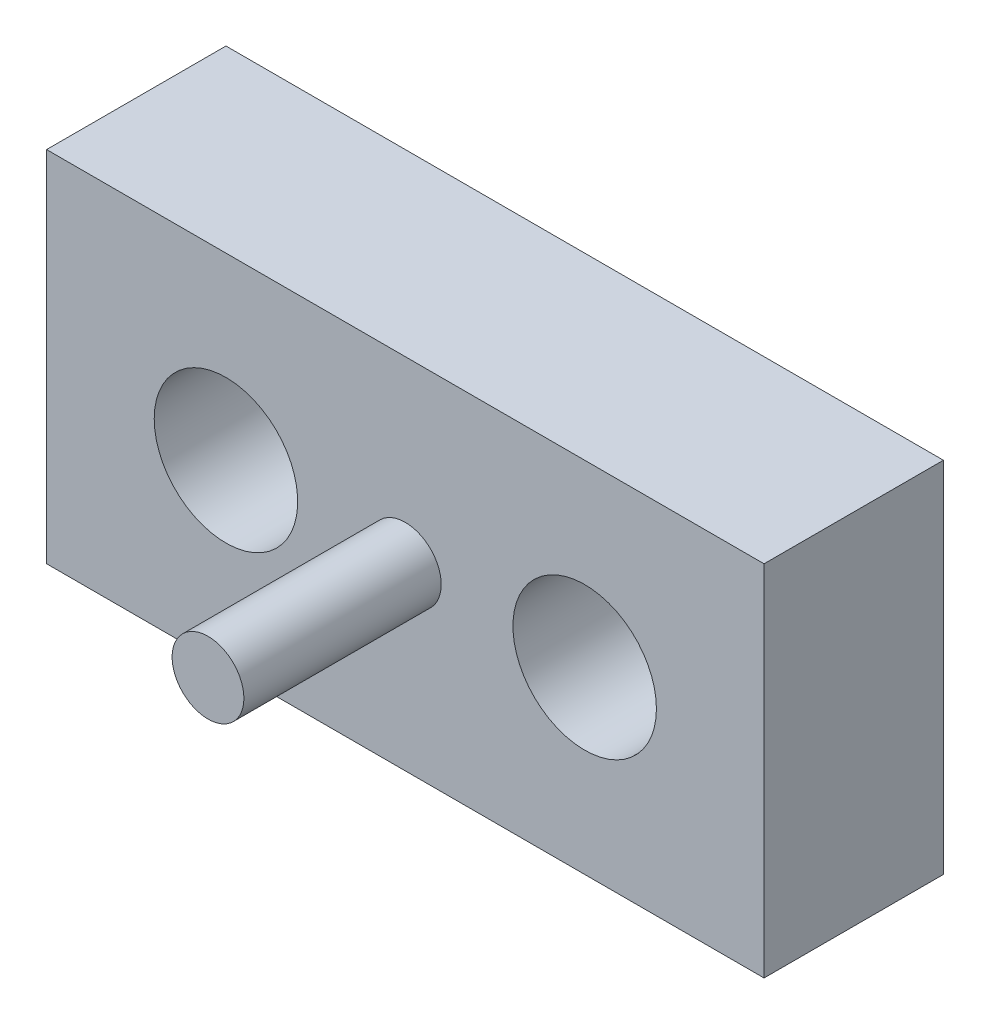
ISO-10303-21;
HEADER;
FILE_DESCRIPTION(('STEP AP214'),'2;1');
FILE_NAME('part.step','',(''),(''),'','','');
FILE_SCHEMA(('AUTOMOTIVE_DESIGN { 1 0 10303 214 1 1 1 1 }'));
ENDSEC;
DATA;
#1=APPLICATION_CONTEXT('core data for automotive mechanical design processes');
#2=APPLICATION_PROTOCOL_DEFINITION('international standard','automotive_design',2000,#1);
#3=PRODUCT_CONTEXT('',#1,'mechanical');
#4=PRODUCT('Part','Part','',(#3));
#5=PRODUCT_RELATED_PRODUCT_CATEGORY('part','',(#4));
#6=PRODUCT_DEFINITION_FORMATION('','',#4);
#7=PRODUCT_DEFINITION_CONTEXT('part definition',#1,'design');
#8=PRODUCT_DEFINITION('design','',#6,#7);
#9=PRODUCT_DEFINITION_SHAPE('','',#8);
#10=(LENGTH_UNIT() NAMED_UNIT(*) SI_UNIT(.MILLI.,.METRE.));
#11=(NAMED_UNIT(*) PLANE_ANGLE_UNIT() SI_UNIT($,.RADIAN.));
#12=(NAMED_UNIT(*) SI_UNIT($,.STERADIAN.) SOLID_ANGLE_UNIT());
#13=UNCERTAINTY_MEASURE_WITH_UNIT(LENGTH_MEASURE(1.E-05),#10,'distance_accuracy_value','');
#14=(GEOMETRIC_REPRESENTATION_CONTEXT(3) GLOBAL_UNCERTAINTY_ASSIGNED_CONTEXT((#13)) GLOBAL_UNIT_ASSIGNED_CONTEXT((#10,
#11,#12)) REPRESENTATION_CONTEXT('',''));
#15=CARTESIAN_POINT('',(0.,0.,0.));
#16=DIRECTION('',(0.,0.,1.));
#17=DIRECTION('',(1.,0.,0.));
#18=AXIS2_PLACEMENT_3D('',#15,#16,#17);
#19=CARTESIAN_POINT('',(4.99999999999999,0.,5.));
#20=DIRECTION('',(0.,0.,-1.));
#21=DIRECTION('',(-1.,0.,0.));
#22=AXIS2_PLACEMENT_3D('',#19,#20,#21);
#23=CYLINDRICAL_SURFACE('',#22,1.);
#24=CARTESIAN_POINT('',(4.99999999999999,0.,0.));
#25=DIRECTION('',(0.,0.,1.));
#26=DIRECTION('',(-1.,0.,0.));
#27=AXIS2_PLACEMENT_3D('',#24,#25,#26);
#28=CIRCLE('',#27,1.);
#29=CARTESIAN_POINT('',(3.99999999999999,0.,0.));
#30=VERTEX_POINT('',#29);
#31=EDGE_CURVE('E156',#30,#30,#28,.T.);
#32=ORIENTED_EDGE('',*,*,#31,.F.);
#33=EDGE_LOOP('',(#32));
#34=FACE_BOUND('',#33,.T.);
#35=CARTESIAN_POINT('',(4.99999999999999,0.,2.));
#36=DIRECTION('',(0.,0.,1.));
#37=DIRECTION('',(1.,0.,0.));
#38=AXIS2_PLACEMENT_3D('',#35,#36,#37);
#39=CIRCLE('',#38,1.);
#40=CARTESIAN_POINT('',(5.99999999999999,0.,2.));
#41=VERTEX_POINT('',#40);
#42=EDGE_CURVE('E125',#41,#41,#39,.T.);
#43=ORIENTED_EDGE('',*,*,#42,.T.);
#44=EDGE_LOOP('',(#43));
#45=FACE_BOUND('',#44,.T.);
#46=ADVANCED_FACE('F39',(#34,#45),#23,.F.);
#47=CARTESIAN_POINT('',(0.,0.,5.));
#48=DIRECTION('',(0.,0.,1.));
#49=DIRECTION('',(1.,0.,0.));
#50=AXIS2_PLACEMENT_3D('',#47,#48,#49);
#51=PLANE('',#50);
#52=CARTESIAN_POINT('',(4.99999999999999,0.,5.));
#53=DIRECTION('',(0.,0.,1.));
#54=DIRECTION('',(1.,0.,0.));
#55=AXIS2_PLACEMENT_3D('',#52,#53,#54);
#56=CIRCLE('',#55,2.);
#57=CARTESIAN_POINT('',(6.99999999999999,0.,5.));
#58=VERTEX_POINT('',#57);
#59=EDGE_CURVE('E136',#58,#58,#56,.T.);
#60=ORIENTED_EDGE('',*,*,#59,.F.);
#61=EDGE_LOOP('',(#60));
#62=FACE_BOUND('',#61,.T.);
#63=CARTESIAN_POINT('',(-4.99999999999999,0.,5.));
#64=DIRECTION('',(0.,0.,1.));
#65=DIRECTION('',(-1.,0.,0.));
#66=AXIS2_PLACEMENT_3D('',#63,#64,#65);
#67=CIRCLE('',#66,2.);
#68=CARTESIAN_POINT('',(-6.99999999999999,0.,5.));
#69=VERTEX_POINT('',#68);
#70=EDGE_CURVE('E148',#69,#69,#67,.T.);
#71=ORIENTED_EDGE('',*,*,#70,.F.);
#72=EDGE_LOOP('',(#71));
#73=FACE_BOUND('',#72,.T.);
#74=CARTESIAN_POINT('',(0.,0.,5.));
#75=DIRECTION('',(0.,0.,1.));
#76=DIRECTION('',(1.,0.,0.));
#77=AXIS2_PLACEMENT_3D('',#74,#75,#76);
#78=CIRCLE('',#77,1.);
#79=CARTESIAN_POINT('',(1.,0.,5.));
#80=VERTEX_POINT('',#79);
#81=EDGE_CURVE('E134',#80,#80,#78,.T.);
#82=ORIENTED_EDGE('',*,*,#81,.F.);
#83=EDGE_LOOP('',(#82));
#84=FACE_BOUND('',#83,.T.);
#85=DIRECTION('',(0.,1.,0.));
#86=VECTOR('',#85,1.);
#87=CARTESIAN_POINT('',(9.99999999999999,5.,5.));
#88=LINE('',#87,#86);
#89=CARTESIAN_POINT('',(9.99999999999999,-5.,5.));
#90=VERTEX_POINT('',#89);
#91=CARTESIAN_POINT('',(9.99999999999999,5.,5.));
#92=VERTEX_POINT('',#91);
#93=EDGE_CURVE('E94',#90,#92,#88,.T.);
#94=ORIENTED_EDGE('',*,*,#93,.T.);
#95=DIRECTION('',(-1.,0.,0.));
#96=VECTOR('',#95,1.);
#97=CARTESIAN_POINT('',(-10.,5.,5.));
#98=LINE('',#97,#96);
#99=CARTESIAN_POINT('',(-10.,5.,5.));
#100=VERTEX_POINT('',#99);
#101=EDGE_CURVE('E89',#92,#100,#98,.T.);
#102=ORIENTED_EDGE('',*,*,#101,.T.);
#103=DIRECTION('',(0.,-1.,0.));
#104=VECTOR('',#103,1.);
#105=CARTESIAN_POINT('',(-10.,5.,5.));
#106=LINE('',#105,#104);
#107=CARTESIAN_POINT('',(-10.,-5.,5.));
#108=VERTEX_POINT('',#107);
#109=EDGE_CURVE('E92',#100,#108,#106,.T.);
#110=ORIENTED_EDGE('',*,*,#109,.T.);
#111=DIRECTION('',(1.,0.,0.));
#112=VECTOR('',#111,1.);
#113=CARTESIAN_POINT('',(-10.,-5.,5.));
#114=LINE('',#113,#112);
#115=EDGE_CURVE('E59',#108,#90,#114,.T.);
#116=ORIENTED_EDGE('',*,*,#115,.T.);
#117=EDGE_LOOP('',(#94,#102,#110,#116));
#118=FACE_BOUND('',#117,.T.);
#119=ADVANCED_FACE('F90',(#62,#73,#84,#118),#51,.T.);
#120=CARTESIAN_POINT('',(0.,0.,0.));
#121=DIRECTION('',(0.,0.,1.));
#122=DIRECTION('',(1.,0.,0.));
#123=AXIS2_PLACEMENT_3D('',#120,#121,#122);
#124=PLANE('',#123);
#125=DIRECTION('',(0.,1.,0.));
#126=VECTOR('',#125,1.);
#127=CARTESIAN_POINT('',(9.99999999999999,5.,0.));
#128=LINE('',#127,#126);
#129=CARTESIAN_POINT('',(9.99999999999999,-5.,0.));
#130=VERTEX_POINT('',#129);
#131=CARTESIAN_POINT('',(9.99999999999999,5.,0.));
#132=VERTEX_POINT('',#131);
#133=EDGE_CURVE('E111',#130,#132,#128,.T.);
#134=ORIENTED_EDGE('',*,*,#133,.F.);
#135=DIRECTION('',(1.,0.,0.));
#136=VECTOR('',#135,1.);
#137=CARTESIAN_POINT('',(-10.,-5.,0.));
#138=LINE('',#137,#136);
#139=CARTESIAN_POINT('',(-10.,-5.,0.));
#140=VERTEX_POINT('',#139);
#141=EDGE_CURVE('E82',#140,#130,#138,.T.);
#142=ORIENTED_EDGE('',*,*,#141,.F.);
#143=DIRECTION('',(0.,-1.,0.));
#144=VECTOR('',#143,1.);
#145=CARTESIAN_POINT('',(-10.,5.,0.));
#146=LINE('',#145,#144);
#147=CARTESIAN_POINT('',(-10.,5.,0.));
#148=VERTEX_POINT('',#147);
#149=EDGE_CURVE('E76',#148,#140,#146,.T.);
#150=ORIENTED_EDGE('',*,*,#149,.F.);
#151=DIRECTION('',(-1.,0.,0.));
#152=VECTOR('',#151,1.);
#153=CARTESIAN_POINT('',(-10.,5.,0.));
#154=LINE('',#153,#152);
#155=EDGE_CURVE('E99',#132,#148,#154,.T.);
#156=ORIENTED_EDGE('',*,*,#155,.F.);
#157=EDGE_LOOP('',(#134,#142,#150,#156));
#158=FACE_BOUND('',#157,.T.);
#159=CARTESIAN_POINT('',(-5.,0.,0.));
#160=DIRECTION('',(0.,0.,1.));
#161=DIRECTION('',(1.,0.,0.));
#162=AXIS2_PLACEMENT_3D('',#159,#160,#161);
#163=CIRCLE('',#162,1.);
#164=CARTESIAN_POINT('',(-4.,0.,0.));
#165=VERTEX_POINT('',#164);
#166=EDGE_CURVE('E115',#165,#165,#163,.T.);
#167=ORIENTED_EDGE('',*,*,#166,.T.);
#168=EDGE_LOOP('',(#167));
#169=FACE_BOUND('',#168,.T.);
#170=ORIENTED_EDGE('',*,*,#31,.T.);
#171=EDGE_LOOP('',(#170));
#172=FACE_BOUND('',#171,.T.);
#173=ADVANCED_FACE('F168',(#158,#169,#172),#124,.F.);
#174=CARTESIAN_POINT('',(9.99999999999999,5.,5.));
#175=DIRECTION('',(-1.,0.,0.));
#176=DIRECTION('',(0.,-1.,0.));
#177=AXIS2_PLACEMENT_3D('',#174,#175,#176);
#178=PLANE('',#177);
#179=ORIENTED_EDGE('',*,*,#133,.T.);
#180=DIRECTION('',(0.,0.,-1.));
#181=VECTOR('',#180,1.);
#182=CARTESIAN_POINT('',(9.99999999999999,5.,5.));
#183=LINE('',#182,#181);
#184=EDGE_CURVE('E11',#92,#132,#183,.T.);
#185=ORIENTED_EDGE('',*,*,#184,.F.);
#186=ORIENTED_EDGE('',*,*,#93,.F.);
#187=DIRECTION('',(0.,0.,-1.));
#188=VECTOR('',#187,1.);
#189=CARTESIAN_POINT('',(9.99999999999999,-5.,5.));
#190=LINE('',#189,#188);
#191=EDGE_CURVE('E107',#90,#130,#190,.T.);
#192=ORIENTED_EDGE('',*,*,#191,.T.);
#193=EDGE_LOOP('',(#179,#185,#186,#192));
#194=FACE_BOUND('',#193,.T.);
#195=ADVANCED_FACE('F41',(#194),#178,.F.);
#196=CARTESIAN_POINT('',(-10.,5.,5.));
#197=DIRECTION('',(0.,-1.,0.));
#198=DIRECTION('',(0.,0.,-1.));
#199=AXIS2_PLACEMENT_3D('',#196,#197,#198);
#200=PLANE('',#199);
#201=ORIENTED_EDGE('',*,*,#155,.T.);
#202=DIRECTION('',(0.,0.,-1.));
#203=VECTOR('',#202,1.);
#204=CARTESIAN_POINT('',(-10.,5.,5.));
#205=LINE('',#204,#203);
#206=EDGE_CURVE('E50',#100,#148,#205,.T.);
#207=ORIENTED_EDGE('',*,*,#206,.F.);
#208=ORIENTED_EDGE('',*,*,#101,.F.);
#209=ORIENTED_EDGE('',*,*,#184,.T.);
#210=EDGE_LOOP('',(#201,#207,#208,#209));
#211=FACE_BOUND('',#210,.T.);
#212=ADVANCED_FACE('F98',(#211),#200,.F.);
#213=CARTESIAN_POINT('',(-10.,5.,5.));
#214=DIRECTION('',(1.,0.,0.));
#215=DIRECTION('',(0.,0.,-1.));
#216=AXIS2_PLACEMENT_3D('',#213,#214,#215);
#217=PLANE('',#216);
#218=ORIENTED_EDGE('',*,*,#149,.T.);
#219=DIRECTION('',(0.,0.,-1.));
#220=VECTOR('',#219,1.);
#221=CARTESIAN_POINT('',(-10.,-5.,5.));
#222=LINE('',#221,#220);
#223=EDGE_CURVE('E101',#108,#140,#222,.T.);
#224=ORIENTED_EDGE('',*,*,#223,.F.);
#225=ORIENTED_EDGE('',*,*,#109,.F.);
#226=ORIENTED_EDGE('',*,*,#206,.T.);
#227=EDGE_LOOP('',(#218,#224,#225,#226));
#228=FACE_BOUND('',#227,.T.);
#229=ADVANCED_FACE('F103',(#228),#217,.F.);
#230=CARTESIAN_POINT('',(-10.,-5.,5.));
#231=DIRECTION('',(0.,1.,0.));
#232=DIRECTION('',(0.,0.,1.));
#233=AXIS2_PLACEMENT_3D('',#230,#231,#232);
#234=PLANE('',#233);
#235=ORIENTED_EDGE('',*,*,#141,.T.);
#236=ORIENTED_EDGE('',*,*,#191,.F.);
#237=ORIENTED_EDGE('',*,*,#115,.F.);
#238=ORIENTED_EDGE('',*,*,#223,.T.);
#239=EDGE_LOOP('',(#235,#236,#237,#238));
#240=FACE_BOUND('',#239,.T.);
#241=ADVANCED_FACE('F174',(#240),#234,.F.);
#242=CARTESIAN_POINT('',(-5.,0.,5.));
#243=DIRECTION('',(0.,0.,-1.));
#244=DIRECTION('',(-1.,0.,0.));
#245=AXIS2_PLACEMENT_3D('',#242,#243,#244);
#246=CYLINDRICAL_SURFACE('',#245,1.);
#247=CARTESIAN_POINT('',(-5.,0.,2.));
#248=DIRECTION('',(0.,0.,-1.));
#249=DIRECTION('',(-1.,0.,0.));
#250=AXIS2_PLACEMENT_3D('',#247,#248,#249);
#251=CIRCLE('',#250,1.);
#252=CARTESIAN_POINT('',(-6.,0.,2.));
#253=VERTEX_POINT('',#252);
#254=EDGE_CURVE('E43',#253,#253,#251,.T.);
#255=ORIENTED_EDGE('',*,*,#254,.F.);
#256=EDGE_LOOP('',(#255));
#257=FACE_BOUND('',#256,.T.);
#258=ORIENTED_EDGE('',*,*,#166,.F.);
#259=EDGE_LOOP('',(#258));
#260=FACE_BOUND('',#259,.T.);
#261=ADVANCED_FACE('F171',(#257,#260),#246,.F.);
#262=CARTESIAN_POINT('',(0.,0.,10.5));
#263=DIRECTION('',(0.,0.,-1.));
#264=DIRECTION('',(-1.,0.,0.));
#265=AXIS2_PLACEMENT_3D('',#262,#263,#264);
#266=CYLINDRICAL_SURFACE('',#265,1.);
#267=CARTESIAN_POINT('',(0.,0.,10.5));
#268=DIRECTION('',(0.,0.,1.));
#269=DIRECTION('',(1.,0.,0.));
#270=AXIS2_PLACEMENT_3D('',#267,#268,#269);
#271=CIRCLE('',#270,1.);
#272=CARTESIAN_POINT('',(1.,0.,10.5));
#273=VERTEX_POINT('',#272);
#274=EDGE_CURVE('E152',#273,#273,#271,.T.);
#275=ORIENTED_EDGE('',*,*,#274,.F.);
#276=EDGE_LOOP('',(#275));
#277=FACE_BOUND('',#276,.T.);
#278=ORIENTED_EDGE('',*,*,#81,.T.);
#279=EDGE_LOOP('',(#278));
#280=FACE_BOUND('',#279,.T.);
#281=ADVANCED_FACE('F173',(#277,#280),#266,.T.);
#282=CARTESIAN_POINT('',(0.,0.,10.5));
#283=DIRECTION('',(0.,0.,1.));
#284=DIRECTION('',(1.,0.,0.));
#285=AXIS2_PLACEMENT_3D('',#282,#283,#284);
#286=PLANE('',#285);
#287=ORIENTED_EDGE('',*,*,#274,.T.);
#288=EDGE_LOOP('',(#287));
#289=FACE_BOUND('',#288,.T.);
#290=ADVANCED_FACE('F182',(#289),#286,.T.);
#291=CARTESIAN_POINT('',(4.99999999999999,0.,2.));
#292=DIRECTION('',(0.,0.,1.));
#293=DIRECTION('',(1.,0.,0.));
#294=AXIS2_PLACEMENT_3D('',#291,#292,#293);
#295=CYLINDRICAL_SURFACE('',#294,2.);
#296=CARTESIAN_POINT('',(4.99999999999999,0.,2.));
#297=DIRECTION('',(0.,0.,1.));
#298=DIRECTION('',(1.,0.,0.));
#299=AXIS2_PLACEMENT_3D('',#296,#297,#298);
#300=CIRCLE('',#299,2.);
#301=CARTESIAN_POINT('',(6.99999999999999,0.,2.));
#302=VERTEX_POINT('',#301);
#303=EDGE_CURVE('E128',#302,#302,#300,.T.);
#304=ORIENTED_EDGE('',*,*,#303,.F.);
#305=EDGE_LOOP('',(#304));
#306=FACE_BOUND('',#305,.T.);
#307=ORIENTED_EDGE('',*,*,#59,.T.);
#308=EDGE_LOOP('',(#307));
#309=FACE_BOUND('',#308,.T.);
#310=ADVANCED_FACE('F200',(#306,#309),#295,.F.);
#311=CARTESIAN_POINT('',(4.99999999999999,0.,2.));
#312=DIRECTION('',(0.,0.,1.));
#313=DIRECTION('',(1.,0.,0.));
#314=AXIS2_PLACEMENT_3D('',#311,#312,#313);
#315=PLANE('',#314);
#316=ORIENTED_EDGE('',*,*,#42,.F.);
#317=EDGE_LOOP('',(#316));
#318=FACE_BOUND('',#317,.T.);
#319=ORIENTED_EDGE('',*,*,#303,.T.);
#320=EDGE_LOOP('',(#319));
#321=FACE_BOUND('',#320,.T.);
#322=ADVANCED_FACE('F206',(#318,#321),#315,.T.);
#323=CARTESIAN_POINT('',(-4.99999999999999,0.,2.));
#324=DIRECTION('',(0.,0.,1.));
#325=DIRECTION('',(1.,0.,0.));
#326=AXIS2_PLACEMENT_3D('',#323,#324,#325);
#327=CYLINDRICAL_SURFACE('',#326,2.);
#328=CARTESIAN_POINT('',(-4.99999999999999,0.,2.));
#329=DIRECTION('',(0.,0.,1.));
#330=DIRECTION('',(-1.,0.,0.));
#331=AXIS2_PLACEMENT_3D('',#328,#329,#330);
#332=CIRCLE('',#331,2.);
#333=CARTESIAN_POINT('',(-6.99999999999999,0.,2.));
#334=VERTEX_POINT('',#333);
#335=EDGE_CURVE('E142',#334,#334,#332,.T.);
#336=ORIENTED_EDGE('',*,*,#335,.F.);
#337=EDGE_LOOP('',(#336));
#338=FACE_BOUND('',#337,.T.);
#339=ORIENTED_EDGE('',*,*,#70,.T.);
#340=EDGE_LOOP('',(#339));
#341=FACE_BOUND('',#340,.T.);
#342=ADVANCED_FACE('F202',(#338,#341),#327,.F.);
#343=CARTESIAN_POINT('',(-4.99999999999999,0.,2.));
#344=DIRECTION('',(0.,0.,-1.));
#345=DIRECTION('',(-1.,0.,0.));
#346=AXIS2_PLACEMENT_3D('',#343,#344,#345);
#347=PLANE('',#346);
#348=ORIENTED_EDGE('',*,*,#254,.T.);
#349=EDGE_LOOP('',(#348));
#350=FACE_BOUND('',#349,.T.);
#351=ORIENTED_EDGE('',*,*,#335,.T.);
#352=EDGE_LOOP('',(#351));
#353=FACE_BOUND('',#352,.T.);
#354=ADVANCED_FACE('F205',(#350,#353),#347,.F.);
#355=CLOSED_SHELL('',(#46,#119,#173,#195,#212,#229,#241,#261,#281,#290,#310,#322,#342,#354));
#356=MANIFOLD_SOLID_BREP('B2',#355);
#357=ADVANCED_BREP_SHAPE_REPRESENTATION('',(#18,#356),#14);
#358=SHAPE_DEFINITION_REPRESENTATION(#9,#357);
ENDSEC;
END-ISO-10303-21;
